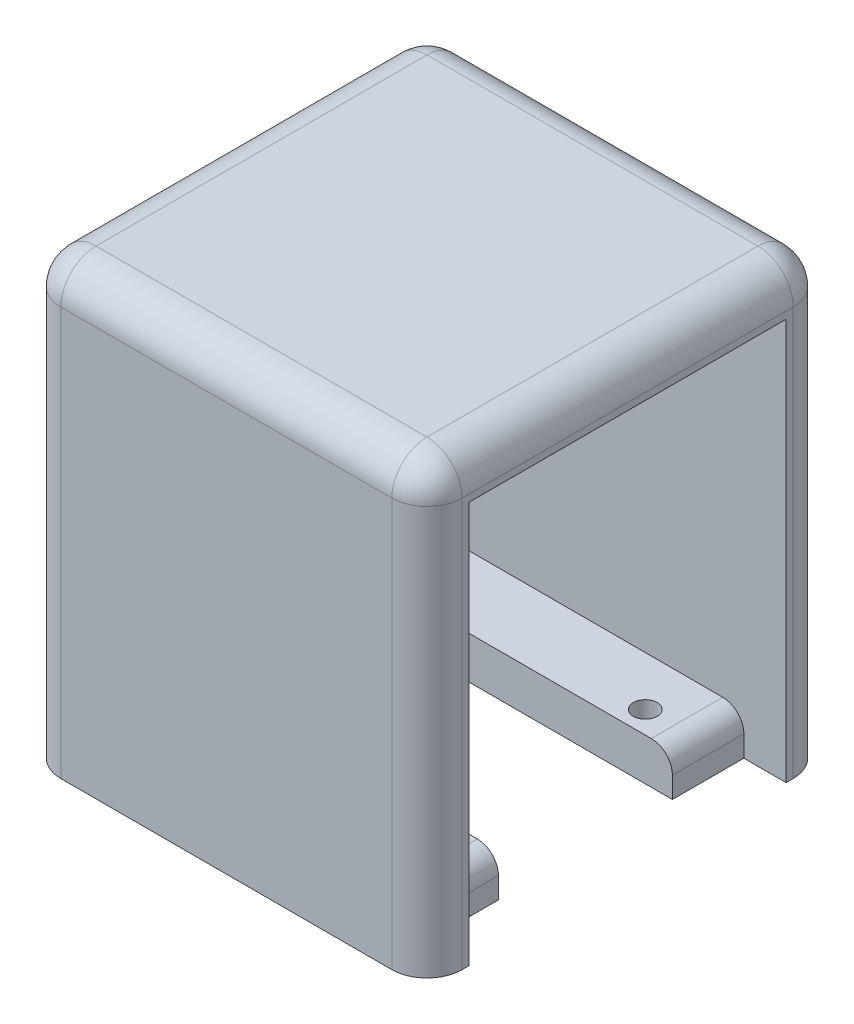
ISO-10303-21;
HEADER;
FILE_DESCRIPTION(('STEP AP214'),'2;1');
FILE_NAME('part.step','',(''),(''),'','','');
FILE_SCHEMA(('AUTOMOTIVE_DESIGN { 1 0 10303 214 1 1 1 1 }'));
ENDSEC;
DATA;
#1=APPLICATION_CONTEXT('core data for automotive mechanical design processes');
#2=APPLICATION_PROTOCOL_DEFINITION('international standard','automotive_design',2000,#1);
#3=PRODUCT_CONTEXT('',#1,'mechanical');
#4=PRODUCT('Part','Part','',(#3));
#5=PRODUCT_RELATED_PRODUCT_CATEGORY('part','',(#4));
#6=PRODUCT_DEFINITION_FORMATION('','',#4);
#7=PRODUCT_DEFINITION_CONTEXT('part definition',#1,'design');
#8=PRODUCT_DEFINITION('design','',#6,#7);
#9=PRODUCT_DEFINITION_SHAPE('','',#8);
#10=(LENGTH_UNIT() NAMED_UNIT(*) SI_UNIT(.MILLI.,.METRE.));
#11=(NAMED_UNIT(*) PLANE_ANGLE_UNIT() SI_UNIT($,.RADIAN.));
#12=(NAMED_UNIT(*) SI_UNIT($,.STERADIAN.) SOLID_ANGLE_UNIT());
#13=UNCERTAINTY_MEASURE_WITH_UNIT(LENGTH_MEASURE(1.E-05),#10,'distance_accuracy_value','');
#14=(GEOMETRIC_REPRESENTATION_CONTEXT(3) GLOBAL_UNCERTAINTY_ASSIGNED_CONTEXT((#13)) GLOBAL_UNIT_ASSIGNED_CONTEXT((#10,
#11,#12)) REPRESENTATION_CONTEXT('',''));
#15=CARTESIAN_POINT('',(0.,0.,0.));
#16=DIRECTION('',(0.,0.,1.));
#17=DIRECTION('',(1.,0.,0.));
#18=AXIS2_PLACEMENT_3D('',#15,#16,#17);
#19=CARTESIAN_POINT('',(0.,6.,0.));
#20=DIRECTION('',(0.,1.,0.));
#21=DIRECTION('',(0.,0.,1.));
#22=AXIS2_PLACEMENT_3D('',#19,#20,#21);
#23=PLANE('',#22);
#24=CARTESIAN_POINT('',(-15.5,6.,-15.5));
#25=DIRECTION('',(0.,1.,0.));
#26=DIRECTION('',(0.,0.,1.));
#27=AXIS2_PLACEMENT_3D('',#24,#25,#26);
#28=CIRCLE('',#27,1.69999999999999);
#29=CARTESIAN_POINT('',(-15.5,6.,-13.8));
#30=VERTEX_POINT('',#29);
#31=EDGE_CURVE('E500',#30,#30,#28,.F.);
#32=ORIENTED_EDGE('',*,*,#31,.T.);
#33=EDGE_LOOP('',(#32));
#34=FACE_BOUND('',#33,.T.);
#35=CARTESIAN_POINT('',(15.5,6.,15.5));
#36=DIRECTION('',(0.,1.,0.));
#37=DIRECTION('',(0.,0.,1.));
#38=AXIS2_PLACEMENT_3D('',#35,#36,#37);
#39=CIRCLE('',#38,1.69999999999999);
#40=CARTESIAN_POINT('',(15.5,6.,17.2));
#41=VERTEX_POINT('',#40);
#42=EDGE_CURVE('E283',#41,#41,#39,.F.);
#43=ORIENTED_EDGE('',*,*,#42,.T.);
#44=EDGE_LOOP('',(#43));
#45=FACE_BOUND('',#44,.T.);
#46=DIRECTION('',(1.,0.,0.));
#47=VECTOR('',#46,1.);
#48=CARTESIAN_POINT('',(0.,6.,22.5));
#49=LINE('',#48,#47);
#50=CARTESIAN_POINT('',(-22.5,6.,22.5));
#51=VERTEX_POINT('',#50);
#52=CARTESIAN_POINT('',(19.5,6.,22.5));
#53=VERTEX_POINT('',#52);
#54=EDGE_CURVE('E267',#51,#53,#49,.T.);
#55=ORIENTED_EDGE('',*,*,#54,.T.);
#56=DIRECTION('',(0.,0.,-1.));
#57=VECTOR('',#56,1.);
#58=CARTESIAN_POINT('',(19.5,6.,12.350491758616));
#59=LINE('',#58,#57);
#60=CARTESIAN_POINT('',(19.5,6.,12.350491758616));
#61=VERTEX_POINT('',#60);
#62=EDGE_CURVE('E265',#53,#61,#59,.T.);
#63=ORIENTED_EDGE('',*,*,#62,.T.);
#64=DIRECTION('',(1.,0.,0.));
#65=VECTOR('',#64,1.);
#66=CARTESIAN_POINT('',(0.,6.,12.350491758616));
#67=LINE('',#66,#65);
#68=CARTESIAN_POINT('',(-12.350491758616,6.,12.350491758616));
#69=VERTEX_POINT('',#68);
#70=EDGE_CURVE('E246',#69,#61,#67,.T.);
#71=ORIENTED_EDGE('',*,*,#70,.F.);
#72=DIRECTION('',(0.,0.,1.));
#73=VECTOR('',#72,1.);
#74=CARTESIAN_POINT('',(-12.350491758616,6.,0.));
#75=LINE('',#74,#73);
#76=CARTESIAN_POINT('',(-12.350491758616,6.,-12.350491758616));
#77=VERTEX_POINT('',#76);
#78=EDGE_CURVE('E263',#77,#69,#75,.T.);
#79=ORIENTED_EDGE('',*,*,#78,.F.);
#80=DIRECTION('',(-1.,0.,0.));
#81=VECTOR('',#80,1.);
#82=CARTESIAN_POINT('',(0.,6.,-12.350491758616));
#83=LINE('',#82,#81);
#84=CARTESIAN_POINT('',(19.5,6.,-12.350491758616));
#85=VERTEX_POINT('',#84);
#86=EDGE_CURVE('E295',#85,#77,#83,.T.);
#87=ORIENTED_EDGE('',*,*,#86,.F.);
#88=DIRECTION('',(0.,0.,-1.));
#89=VECTOR('',#88,1.);
#90=CARTESIAN_POINT('',(19.5,6.,-22.5));
#91=LINE('',#90,#89);
#92=CARTESIAN_POINT('',(19.5,6.,-22.5));
#93=VERTEX_POINT('',#92);
#94=EDGE_CURVE('E406',#85,#93,#91,.T.);
#95=ORIENTED_EDGE('',*,*,#94,.T.);
#96=DIRECTION('',(1.,0.,0.));
#97=VECTOR('',#96,1.);
#98=CARTESIAN_POINT('',(0.,6.,-22.5));
#99=LINE('',#98,#97);
#100=CARTESIAN_POINT('',(-22.5,6.00000000000001,-22.5));
#101=VERTEX_POINT('',#100);
#102=EDGE_CURVE('E487',#101,#93,#99,.T.);
#103=ORIENTED_EDGE('',*,*,#102,.F.);
#104=DIRECTION('',(0.,0.,1.));
#105=VECTOR('',#104,1.);
#106=CARTESIAN_POINT('',(-22.5,6.,0.));
#107=LINE('',#106,#105);
#108=EDGE_CURVE('E470',#101,#51,#107,.T.);
#109=ORIENTED_EDGE('',*,*,#108,.T.);
#110=EDGE_LOOP('',(#55,#63,#71,#79,#87,#95,#103,#109));
#111=FACE_BOUND('',#110,.T.);
#112=CARTESIAN_POINT('',(15.5,6.,-15.5));
#113=DIRECTION('',(0.,1.,0.));
#114=DIRECTION('',(0.,0.,1.));
#115=AXIS2_PLACEMENT_3D('',#112,#113,#114);
#116=CIRCLE('',#115,1.69999999999999);
#117=CARTESIAN_POINT('',(15.5,6.,-13.8));
#118=VERTEX_POINT('',#117);
#119=EDGE_CURVE('E509',#118,#118,#116,.F.);
#120=ORIENTED_EDGE('',*,*,#119,.T.);
#121=EDGE_LOOP('',(#120));
#122=FACE_BOUND('',#121,.T.);
#123=CARTESIAN_POINT('',(-15.5,6.,15.5));
#124=DIRECTION('',(0.,1.,0.));
#125=DIRECTION('',(0.,0.,1.));
#126=AXIS2_PLACEMENT_3D('',#123,#124,#125);
#127=CIRCLE('',#126,1.69999999999999);
#128=CARTESIAN_POINT('',(-15.5,6.,17.2));
#129=VERTEX_POINT('',#128);
#130=EDGE_CURVE('E501',#129,#129,#127,.F.);
#131=ORIENTED_EDGE('',*,*,#130,.T.);
#132=EDGE_LOOP('',(#131));
#133=FACE_BOUND('',#132,.T.);
#134=ADVANCED_FACE('F70',(#34,#45,#111,#122,#133),#23,.T.);
#135=CARTESIAN_POINT('',(-22.5,57.,-22.5));
#136=DIRECTION('',(0.,0.,-1.));
#137=DIRECTION('',(-1.,0.,0.));
#138=AXIS2_PLACEMENT_3D('',#135,#136,#137);
#139=PLANE('',#138);
#140=ORIENTED_EDGE('',*,*,#102,.T.);
#141=CARTESIAN_POINT('',(19.5,3.,-22.5));
#142=DIRECTION('',(0.,0.,-1.));
#143=DIRECTION('',(-1.,0.,0.));
#144=AXIS2_PLACEMENT_3D('',#141,#142,#143);
#145=CIRCLE('',#144,3.);
#146=CARTESIAN_POINT('',(22.5,3.,-22.5));
#147=VERTEX_POINT('',#146);
#148=EDGE_CURVE('E12',#93,#147,#145,.T.);
#149=ORIENTED_EDGE('',*,*,#148,.T.);
#150=DIRECTION('',(0.,-1.,0.));
#151=VECTOR('',#150,1.);
#152=CARTESIAN_POINT('',(22.5,6.,-22.5));
#153=LINE('',#152,#151);
#154=CARTESIAN_POINT('',(22.5,0.,-22.5));
#155=VERTEX_POINT('',#154);
#156=EDGE_CURVE('E302',#147,#155,#153,.T.);
#157=ORIENTED_EDGE('',*,*,#156,.T.);
#158=DIRECTION('',(1.,0.,0.));
#159=VECTOR('',#158,1.);
#160=CARTESIAN_POINT('',(-22.5,0.,-22.5));
#161=LINE('',#160,#159);
#162=CARTESIAN_POINT('',(28.5,0.,-22.5));
#163=VERTEX_POINT('',#162);
#164=EDGE_CURVE('E329',#155,#163,#161,.T.);
#165=ORIENTED_EDGE('',*,*,#164,.T.);
#166=DIRECTION('',(0.,1.,0.));
#167=VECTOR('',#166,1.);
#168=CARTESIAN_POINT('',(28.5,57.,-22.5));
#169=LINE('',#168,#167);
#170=CARTESIAN_POINT('',(28.5,57.,-22.5));
#171=VERTEX_POINT('',#170);
#172=EDGE_CURVE('E308',#163,#171,#169,.T.);
#173=ORIENTED_EDGE('',*,*,#172,.T.);
#174=DIRECTION('',(1.,0.,0.));
#175=VECTOR('',#174,1.);
#176=CARTESIAN_POINT('',(-22.5,57.,-22.5));
#177=LINE('',#176,#175);
#178=CARTESIAN_POINT('',(-22.5,57.,-22.5));
#179=VERTEX_POINT('',#178);
#180=EDGE_CURVE('E328',#179,#171,#177,.T.);
#181=ORIENTED_EDGE('',*,*,#180,.F.);
#182=DIRECTION('',(0.,1.,0.));
#183=VECTOR('',#182,1.);
#184=CARTESIAN_POINT('',(-22.5,57.,-22.5));
#185=LINE('',#184,#183);
#186=EDGE_CURVE('E319',#101,#179,#185,.T.);
#187=ORIENTED_EDGE('',*,*,#186,.F.);
#188=EDGE_LOOP('',(#140,#149,#157,#165,#173,#181,#187));
#189=FACE_BOUND('',#188,.T.);
#190=ADVANCED_FACE('F539',(#189),#139,.F.);
#191=CARTESIAN_POINT('',(-22.5,0.,22.5));
#192=DIRECTION('',(0.,0.,1.));
#193=DIRECTION('',(1.,0.,0.));
#194=AXIS2_PLACEMENT_3D('',#191,#192,#193);
#195=PLANE('',#194);
#196=DIRECTION('',(0.,-1.,0.));
#197=VECTOR('',#196,1.);
#198=CARTESIAN_POINT('',(22.5,6.,22.5));
#199=LINE('',#198,#197);
#200=CARTESIAN_POINT('',(22.5,3.,22.5));
#201=VERTEX_POINT('',#200);
#202=CARTESIAN_POINT('',(22.5,0.,22.5));
#203=VERTEX_POINT('',#202);
#204=EDGE_CURVE('E299',#201,#203,#199,.T.);
#205=ORIENTED_EDGE('',*,*,#204,.F.);
#206=CARTESIAN_POINT('',(19.5,3.,22.5));
#207=DIRECTION('',(0.,0.,1.));
#208=DIRECTION('',(1.,0.,0.));
#209=AXIS2_PLACEMENT_3D('',#206,#207,#208);
#210=CIRCLE('',#209,3.);
#211=EDGE_CURVE('E79',#201,#53,#210,.T.);
#212=ORIENTED_EDGE('',*,*,#211,.T.);
#213=ORIENTED_EDGE('',*,*,#54,.F.);
#214=DIRECTION('',(0.,-1.,0.));
#215=VECTOR('',#214,1.);
#216=CARTESIAN_POINT('',(-22.5,0.,22.5));
#217=LINE('',#216,#215);
#218=CARTESIAN_POINT('',(-22.5,57.,22.5));
#219=VERTEX_POINT('',#218);
#220=EDGE_CURVE('E325',#219,#51,#217,.T.);
#221=ORIENTED_EDGE('',*,*,#220,.F.);
#222=DIRECTION('',(1.,0.,0.));
#223=VECTOR('',#222,1.);
#224=CARTESIAN_POINT('',(-22.5,57.,22.5));
#225=LINE('',#224,#223);
#226=CARTESIAN_POINT('',(28.5,57.,22.5));
#227=VERTEX_POINT('',#226);
#228=EDGE_CURVE('E337',#219,#227,#225,.T.);
#229=ORIENTED_EDGE('',*,*,#228,.T.);
#230=DIRECTION('',(0.,-1.,0.));
#231=VECTOR('',#230,1.);
#232=CARTESIAN_POINT('',(28.5,0.,22.5));
#233=LINE('',#232,#231);
#234=CARTESIAN_POINT('',(28.5,0.,22.5));
#235=VERTEX_POINT('',#234);
#236=EDGE_CURVE('E315',#227,#235,#233,.T.);
#237=ORIENTED_EDGE('',*,*,#236,.T.);
#238=DIRECTION('',(1.,0.,0.));
#239=VECTOR('',#238,1.);
#240=CARTESIAN_POINT('',(-22.5,0.,22.5));
#241=LINE('',#240,#239);
#242=EDGE_CURVE('E334',#203,#235,#241,.T.);
#243=ORIENTED_EDGE('',*,*,#242,.F.);
#244=EDGE_LOOP('',(#205,#212,#213,#221,#229,#237,#243));
#245=FACE_BOUND('',#244,.T.);
#246=ADVANCED_FACE('F463',(#245),#195,.F.);
#247=CARTESIAN_POINT('',(0.,0.,0.));
#248=DIRECTION('',(0.,1.,0.));
#249=DIRECTION('',(0.,0.,1.));
#250=AXIS2_PLACEMENT_3D('',#247,#248,#249);
#251=PLANE('',#250);
#252=CARTESIAN_POINT('',(-15.5,0.,15.5));
#253=DIRECTION('',(0.,-1.,0.));
#254=DIRECTION('',(0.,0.,-1.));
#255=AXIS2_PLACEMENT_3D('',#252,#253,#254);
#256=CIRCLE('',#255,1.69999999999999);
#257=CARTESIAN_POINT('',(-15.5,0.,13.8));
#258=VERTEX_POINT('',#257);
#259=EDGE_CURVE('E443',#258,#258,#256,.T.);
#260=ORIENTED_EDGE('',*,*,#259,.F.);
#261=EDGE_LOOP('',(#260));
#262=FACE_BOUND('',#261,.T.);
#263=CARTESIAN_POINT('',(-15.5,0.,-15.5));
#264=DIRECTION('',(0.,-1.,0.));
#265=DIRECTION('',(0.,0.,-1.));
#266=AXIS2_PLACEMENT_3D('',#263,#264,#265);
#267=CIRCLE('',#266,1.69999999999999);
#268=CARTESIAN_POINT('',(-15.5,0.,-17.2));
#269=VERTEX_POINT('',#268);
#270=EDGE_CURVE('E497',#269,#269,#267,.T.);
#271=ORIENTED_EDGE('',*,*,#270,.F.);
#272=EDGE_LOOP('',(#271));
#273=FACE_BOUND('',#272,.T.);
#274=CARTESIAN_POINT('',(15.5,0.,-15.5));
#275=DIRECTION('',(0.,-1.,0.));
#276=DIRECTION('',(0.,0.,-1.));
#277=AXIS2_PLACEMENT_3D('',#274,#275,#276);
#278=CIRCLE('',#277,1.69999999999999);
#279=CARTESIAN_POINT('',(15.5,0.,-17.2));
#280=VERTEX_POINT('',#279);
#281=EDGE_CURVE('E504',#280,#280,#278,.T.);
#282=ORIENTED_EDGE('',*,*,#281,.F.);
#283=EDGE_LOOP('',(#282));
#284=FACE_BOUND('',#283,.T.);
#285=CARTESIAN_POINT('',(15.5,0.,15.5));
#286=DIRECTION('',(0.,-1.,0.));
#287=DIRECTION('',(0.,0.,-1.));
#288=AXIS2_PLACEMENT_3D('',#285,#286,#287);
#289=CIRCLE('',#288,1.69999999999999);
#290=CARTESIAN_POINT('',(15.5,0.,13.8));
#291=VERTEX_POINT('',#290);
#292=EDGE_CURVE('E515',#291,#291,#289,.T.);
#293=ORIENTED_EDGE('',*,*,#292,.F.);
#294=EDGE_LOOP('',(#293));
#295=FACE_BOUND('',#294,.T.);
#296=DIRECTION('',(0.,0.,1.));
#297=VECTOR('',#296,1.);
#298=CARTESIAN_POINT('',(-28.4999999999999,0.,0.));
#299=LINE('',#298,#297);
#300=CARTESIAN_POINT('',(-28.4999999999999,0.,-23.5));
#301=VERTEX_POINT('',#300);
#302=CARTESIAN_POINT('',(-28.4999999999999,0.,23.5));
#303=VERTEX_POINT('',#302);
#304=EDGE_CURVE('E349',#301,#303,#299,.T.);
#305=ORIENTED_EDGE('',*,*,#304,.F.);
#306=CARTESIAN_POINT('',(-23.4999999999999,0.,-23.5));
#307=DIRECTION('',(0.,1.,0.));
#308=DIRECTION('',(0.,0.,1.));
#309=AXIS2_PLACEMENT_3D('',#306,#307,#308);
#310=CIRCLE('',#309,5.);
#311=CARTESIAN_POINT('',(-23.4999999999999,0.,-28.5));
#312=VERTEX_POINT('',#311);
#313=EDGE_CURVE('E404',#301,#312,#310,.F.);
#314=ORIENTED_EDGE('',*,*,#313,.T.);
#315=DIRECTION('',(1.,0.,0.));
#316=VECTOR('',#315,1.);
#317=CARTESIAN_POINT('',(0.,0.,-28.5));
#318=LINE('',#317,#316);
#319=CARTESIAN_POINT('',(23.5,0.,-28.5));
#320=VERTEX_POINT('',#319);
#321=EDGE_CURVE('E345',#312,#320,#318,.T.);
#322=ORIENTED_EDGE('',*,*,#321,.T.);
#323=CARTESIAN_POINT('',(23.5,0.,-23.5));
#324=DIRECTION('',(0.,1.,0.));
#325=DIRECTION('',(0.,0.,1.));
#326=AXIS2_PLACEMENT_3D('',#323,#324,#325);
#327=CIRCLE('',#326,5.);
#328=CARTESIAN_POINT('',(28.5,0.,-23.5));
#329=VERTEX_POINT('',#328);
#330=EDGE_CURVE('E401',#320,#329,#327,.F.);
#331=ORIENTED_EDGE('',*,*,#330,.T.);
#332=DIRECTION('',(0.,0.,1.));
#333=VECTOR('',#332,1.);
#334=CARTESIAN_POINT('',(28.5,0.,0.));
#335=LINE('',#334,#333);
#336=EDGE_CURVE('E342',#329,#163,#335,.T.);
#337=ORIENTED_EDGE('',*,*,#336,.T.);
#338=ORIENTED_EDGE('',*,*,#164,.F.);
#339=DIRECTION('',(0.,0.,-1.));
#340=VECTOR('',#339,1.);
#341=CARTESIAN_POINT('',(22.5,0.,0.));
#342=LINE('',#341,#340);
#343=CARTESIAN_POINT('',(22.5,0.,-12.350491758616));
#344=VERTEX_POINT('',#343);
#345=EDGE_CURVE('E282',#344,#155,#342,.T.);
#346=ORIENTED_EDGE('',*,*,#345,.F.);
#347=DIRECTION('',(-1.,0.,0.));
#348=VECTOR('',#347,1.);
#349=CARTESIAN_POINT('',(0.,0.,-12.350491758616));
#350=LINE('',#349,#348);
#351=CARTESIAN_POINT('',(-12.350491758616,0.,-12.350491758616));
#352=VERTEX_POINT('',#351);
#353=EDGE_CURVE('E278',#344,#352,#350,.T.);
#354=ORIENTED_EDGE('',*,*,#353,.T.);
#355=DIRECTION('',(0.,0.,1.));
#356=VECTOR('',#355,1.);
#357=CARTESIAN_POINT('',(-12.350491758616,0.,0.));
#358=LINE('',#357,#356);
#359=CARTESIAN_POINT('',(-12.350491758616,0.,12.350491758616));
#360=VERTEX_POINT('',#359);
#361=EDGE_CURVE('E293',#352,#360,#358,.T.);
#362=ORIENTED_EDGE('',*,*,#361,.T.);
#363=DIRECTION('',(1.,0.,0.));
#364=VECTOR('',#363,1.);
#365=CARTESIAN_POINT('',(0.,0.,12.350491758616));
#366=LINE('',#365,#364);
#367=CARTESIAN_POINT('',(22.5,0.,12.350491758616));
#368=VERTEX_POINT('',#367);
#369=EDGE_CURVE('E248',#360,#368,#366,.T.);
#370=ORIENTED_EDGE('',*,*,#369,.T.);
#371=DIRECTION('',(0.,0.,-1.));
#372=VECTOR('',#371,1.);
#373=CARTESIAN_POINT('',(22.5,0.,0.));
#374=LINE('',#373,#372);
#375=EDGE_CURVE('E287',#203,#368,#374,.T.);
#376=ORIENTED_EDGE('',*,*,#375,.F.);
#377=ORIENTED_EDGE('',*,*,#242,.T.);
#378=CARTESIAN_POINT('',(28.5,0.,23.5));
#379=VERTEX_POINT('',#378);
#380=EDGE_CURVE('E333',#235,#379,#335,.T.);
#381=ORIENTED_EDGE('',*,*,#380,.T.);
#382=CARTESIAN_POINT('',(23.5,0.,23.5));
#383=DIRECTION('',(0.,1.,0.));
#384=DIRECTION('',(0.,0.,1.));
#385=AXIS2_PLACEMENT_3D('',#382,#383,#384);
#386=CIRCLE('',#385,5.);
#387=CARTESIAN_POINT('',(23.5,0.,28.5));
#388=VERTEX_POINT('',#387);
#389=EDGE_CURVE('E396',#379,#388,#386,.F.);
#390=ORIENTED_EDGE('',*,*,#389,.T.);
#391=DIRECTION('',(1.,0.,0.));
#392=VECTOR('',#391,1.);
#393=CARTESIAN_POINT('',(0.,0.,28.5));
#394=LINE('',#393,#392);
#395=CARTESIAN_POINT('',(-23.4999999999999,0.,28.5));
#396=VERTEX_POINT('',#395);
#397=EDGE_CURVE('E352',#396,#388,#394,.T.);
#398=ORIENTED_EDGE('',*,*,#397,.F.);
#399=CARTESIAN_POINT('',(-23.4999999999999,0.,23.5));
#400=DIRECTION('',(0.,1.,0.));
#401=DIRECTION('',(0.,0.,1.));
#402=AXIS2_PLACEMENT_3D('',#399,#400,#401);
#403=CIRCLE('',#402,5.);
#404=EDGE_CURVE('E399',#396,#303,#403,.F.);
#405=ORIENTED_EDGE('',*,*,#404,.T.);
#406=EDGE_LOOP('',(#305,#314,#322,#331,#337,#338,#346,#354,#362,#370,#376,#377,#381,#390,#398,#405));
#407=FACE_BOUND('',#406,.T.);
#408=ADVANCED_FACE('F479',(#262,#273,#284,#295,#407),#251,.F.);
#409=CARTESIAN_POINT('',(-28.4999999999999,63.,0.));
#410=DIRECTION('',(1.,0.,0.));
#411=DIRECTION('',(0.,0.,-1.));
#412=AXIS2_PLACEMENT_3D('',#409,#410,#411);
#413=PLANE('',#412);
#414=DIRECTION('',(0.,0.,1.));
#415=VECTOR('',#414,1.);
#416=CARTESIAN_POINT('',(-28.4999999999999,58.,-28.5));
#417=LINE('',#416,#415);
#418=CARTESIAN_POINT('',(-28.4999999999999,58.,23.5));
#419=VERTEX_POINT('',#418);
#420=CARTESIAN_POINT('',(-28.4999999999999,58.,-23.5));
#421=VERTEX_POINT('',#420);
#422=EDGE_CURVE('E383',#419,#421,#417,.F.);
#423=ORIENTED_EDGE('',*,*,#422,.T.);
#424=DIRECTION('',(0.,-1.,0.));
#425=VECTOR('',#424,1.);
#426=CARTESIAN_POINT('',(-28.4999999999999,0.,-23.5));
#427=LINE('',#426,#425);
#428=EDGE_CURVE('E385',#421,#301,#427,.T.);
#429=ORIENTED_EDGE('',*,*,#428,.T.);
#430=ORIENTED_EDGE('',*,*,#304,.T.);
#431=DIRECTION('',(0.,-1.,0.));
#432=VECTOR('',#431,1.);
#433=CARTESIAN_POINT('',(-28.4999999999999,63.,23.5));
#434=LINE('',#433,#432);
#435=EDGE_CURVE('E381',#303,#419,#434,.F.);
#436=ORIENTED_EDGE('',*,*,#435,.T.);
#437=EDGE_LOOP('',(#423,#429,#430,#436));
#438=FACE_BOUND('',#437,.T.);
#439=ADVANCED_FACE('F561',(#438),#413,.F.);
#440=CARTESIAN_POINT('',(0.,63.,-28.5));
#441=DIRECTION('',(0.,0.,-1.));
#442=DIRECTION('',(-1.,0.,0.));
#443=AXIS2_PLACEMENT_3D('',#440,#441,#442);
#444=PLANE('',#443);
#445=ORIENTED_EDGE('',*,*,#321,.F.);
#446=DIRECTION('',(0.,-1.,0.));
#447=VECTOR('',#446,1.);
#448=CARTESIAN_POINT('',(-23.4999999999999,63.,-28.5));
#449=LINE('',#448,#447);
#450=CARTESIAN_POINT('',(-23.4999999999999,58.,-28.5));
#451=VERTEX_POINT('',#450);
#452=EDGE_CURVE('E362',#312,#451,#449,.F.);
#453=ORIENTED_EDGE('',*,*,#452,.T.);
#454=DIRECTION('',(1.,0.,0.));
#455=VECTOR('',#454,1.);
#456=CARTESIAN_POINT('',(0.,58.,-28.5));
#457=LINE('',#456,#455);
#458=CARTESIAN_POINT('',(23.5,58.,-28.5));
#459=VERTEX_POINT('',#458);
#460=EDGE_CURVE('E359',#451,#459,#457,.T.);
#461=ORIENTED_EDGE('',*,*,#460,.T.);
#462=DIRECTION('',(0.,-1.,0.));
#463=VECTOR('',#462,1.);
#464=CARTESIAN_POINT('',(23.5,63.,-28.5));
#465=LINE('',#464,#463);
#466=EDGE_CURVE('E356',#459,#320,#465,.T.);
#467=ORIENTED_EDGE('',*,*,#466,.T.);
#468=EDGE_LOOP('',(#445,#453,#461,#467));
#469=FACE_BOUND('',#468,.T.);
#470=ADVANCED_FACE('F573',(#469),#444,.T.);
#471=CARTESIAN_POINT('',(28.5,63.,0.));
#472=DIRECTION('',(1.,0.,0.));
#473=DIRECTION('',(0.,0.,-1.));
#474=AXIS2_PLACEMENT_3D('',#471,#472,#473);
#475=PLANE('',#474);
#476=ORIENTED_EDGE('',*,*,#336,.F.);
#477=DIRECTION('',(0.,-1.,0.));
#478=VECTOR('',#477,1.);
#479=CARTESIAN_POINT('',(28.5,63.,-23.5));
#480=LINE('',#479,#478);
#481=CARTESIAN_POINT('',(28.5,58.,-23.5));
#482=VERTEX_POINT('',#481);
#483=EDGE_CURVE('E393',#329,#482,#480,.F.);
#484=ORIENTED_EDGE('',*,*,#483,.T.);
#485=DIRECTION('',(0.,0.,1.));
#486=VECTOR('',#485,1.);
#487=CARTESIAN_POINT('',(28.5,58.,0.));
#488=LINE('',#487,#486);
#489=CARTESIAN_POINT('',(28.5,58.,23.5));
#490=VERTEX_POINT('',#489);
#491=EDGE_CURVE('E390',#482,#490,#488,.T.);
#492=ORIENTED_EDGE('',*,*,#491,.T.);
#493=DIRECTION('',(0.,-1.,0.));
#494=VECTOR('',#493,1.);
#495=CARTESIAN_POINT('',(28.5,0.,23.5));
#496=LINE('',#495,#494);
#497=EDGE_CURVE('E387',#490,#379,#496,.T.);
#498=ORIENTED_EDGE('',*,*,#497,.T.);
#499=ORIENTED_EDGE('',*,*,#380,.F.);
#500=ORIENTED_EDGE('',*,*,#236,.F.);
#501=DIRECTION('',(0.,0.,1.));
#502=VECTOR('',#501,1.);
#503=CARTESIAN_POINT('',(28.5,57.,22.5));
#504=LINE('',#503,#502);
#505=EDGE_CURVE('E311',#171,#227,#504,.T.);
#506=ORIENTED_EDGE('',*,*,#505,.F.);
#507=ORIENTED_EDGE('',*,*,#172,.F.);
#508=EDGE_LOOP('',(#476,#484,#492,#498,#499,#500,#506,#507));
#509=FACE_BOUND('',#508,.T.);
#510=ADVANCED_FACE('F576',(#509),#475,.T.);
#511=CARTESIAN_POINT('',(0.,63.,28.5));
#512=DIRECTION('',(0.,0.,-1.));
#513=DIRECTION('',(-1.,0.,0.));
#514=AXIS2_PLACEMENT_3D('',#511,#512,#513);
#515=PLANE('',#514);
#516=DIRECTION('',(1.,0.,0.));
#517=VECTOR('',#516,1.);
#518=CARTESIAN_POINT('',(-28.4999999999999,58.,28.5));
#519=LINE('',#518,#517);
#520=CARTESIAN_POINT('',(23.5,58.,28.5));
#521=VERTEX_POINT('',#520);
#522=CARTESIAN_POINT('',(-23.4999999999999,58.,28.5));
#523=VERTEX_POINT('',#522);
#524=EDGE_CURVE('E377',#521,#523,#519,.F.);
#525=ORIENTED_EDGE('',*,*,#524,.T.);
#526=DIRECTION('',(0.,-1.,0.));
#527=VECTOR('',#526,1.);
#528=CARTESIAN_POINT('',(-23.4999999999999,63.,28.5));
#529=LINE('',#528,#527);
#530=EDGE_CURVE('E379',#523,#396,#529,.T.);
#531=ORIENTED_EDGE('',*,*,#530,.T.);
#532=ORIENTED_EDGE('',*,*,#397,.T.);
#533=DIRECTION('',(0.,-1.,0.));
#534=VECTOR('',#533,1.);
#535=CARTESIAN_POINT('',(23.5,63.,28.5));
#536=LINE('',#535,#534);
#537=EDGE_CURVE('E374',#388,#521,#536,.F.);
#538=ORIENTED_EDGE('',*,*,#537,.T.);
#539=EDGE_LOOP('',(#525,#531,#532,#538));
#540=FACE_BOUND('',#539,.T.);
#541=ADVANCED_FACE('F568',(#540),#515,.F.);
#542=CARTESIAN_POINT('',(0.,63.,0.));
#543=DIRECTION('',(0.,1.,0.));
#544=DIRECTION('',(0.,0.,1.));
#545=AXIS2_PLACEMENT_3D('',#542,#543,#544);
#546=PLANE('',#545);
#547=DIRECTION('',(1.,0.,0.));
#548=VECTOR('',#547,1.);
#549=CARTESIAN_POINT('',(0.,63.,-23.5));
#550=LINE('',#549,#548);
#551=CARTESIAN_POINT('',(23.5,63.,-23.5));
#552=VERTEX_POINT('',#551);
#553=CARTESIAN_POINT('',(-23.4999999999999,63.,-23.5));
#554=VERTEX_POINT('',#553);
#555=EDGE_CURVE('E369',#552,#554,#550,.F.);
#556=ORIENTED_EDGE('',*,*,#555,.T.);
#557=DIRECTION('',(0.,0.,1.));
#558=VECTOR('',#557,1.);
#559=CARTESIAN_POINT('',(-23.4999999999999,63.,28.5));
#560=LINE('',#559,#558);
#561=CARTESIAN_POINT('',(-23.4999999999999,63.,23.5));
#562=VERTEX_POINT('',#561);
#563=EDGE_CURVE('E372',#554,#562,#560,.T.);
#564=ORIENTED_EDGE('',*,*,#563,.T.);
#565=DIRECTION('',(1.,0.,0.));
#566=VECTOR('',#565,1.);
#567=CARTESIAN_POINT('',(28.5,63.,23.5));
#568=LINE('',#567,#566);
#569=CARTESIAN_POINT('',(23.5,63.,23.5));
#570=VERTEX_POINT('',#569);
#571=EDGE_CURVE('E367',#562,#570,#568,.T.);
#572=ORIENTED_EDGE('',*,*,#571,.T.);
#573=DIRECTION('',(0.,0.,1.));
#574=VECTOR('',#573,1.);
#575=CARTESIAN_POINT('',(23.5,63.,0.));
#576=LINE('',#575,#574);
#577=EDGE_CURVE('E364',#570,#552,#576,.F.);
#578=ORIENTED_EDGE('',*,*,#577,.T.);
#579=EDGE_LOOP('',(#556,#564,#572,#578));
#580=FACE_BOUND('',#579,.T.);
#581=ADVANCED_FACE('F563',(#580),#546,.T.);
#582=CARTESIAN_POINT('',(-22.5,57.,22.5));
#583=DIRECTION('',(0.,1.,0.));
#584=DIRECTION('',(0.,0.,1.));
#585=AXIS2_PLACEMENT_3D('',#582,#583,#584);
#586=PLANE('',#585);
#587=ORIENTED_EDGE('',*,*,#228,.F.);
#588=DIRECTION('',(0.,0.,1.));
#589=VECTOR('',#588,1.);
#590=CARTESIAN_POINT('',(-22.5,57.,22.5));
#591=LINE('',#590,#589);
#592=EDGE_CURVE('E322',#179,#219,#591,.T.);
#593=ORIENTED_EDGE('',*,*,#592,.F.);
#594=ORIENTED_EDGE('',*,*,#180,.T.);
#595=ORIENTED_EDGE('',*,*,#505,.T.);
#596=EDGE_LOOP('',(#587,#593,#594,#595));
#597=FACE_BOUND('',#596,.T.);
#598=ADVANCED_FACE('F557',(#597),#586,.F.);
#599=CARTESIAN_POINT('',(-22.5,0.,0.));
#600=DIRECTION('',(1.,0.,0.));
#601=DIRECTION('',(0.,0.,-1.));
#602=AXIS2_PLACEMENT_3D('',#599,#600,#601);
#603=PLANE('',#602);
#604=ORIENTED_EDGE('',*,*,#108,.F.);
#605=ORIENTED_EDGE('',*,*,#186,.T.);
#606=ORIENTED_EDGE('',*,*,#592,.T.);
#607=ORIENTED_EDGE('',*,*,#220,.T.);
#608=EDGE_LOOP('',(#604,#605,#606,#607));
#609=FACE_BOUND('',#608,.T.);
#610=ADVANCED_FACE('F554',(#609),#603,.T.);
#611=CARTESIAN_POINT('',(0.,6.,-12.350491758616));
#612=DIRECTION('',(0.,0.,1.));
#613=DIRECTION('',(1.,0.,0.));
#614=AXIS2_PLACEMENT_3D('',#611,#612,#613);
#615=PLANE('',#614);
#616=DIRECTION('',(0.,-1.,0.));
#617=VECTOR('',#616,1.);
#618=CARTESIAN_POINT('',(22.5,6.,-12.350491758616));
#619=LINE('',#618,#617);
#620=CARTESIAN_POINT('',(22.5,3.,-12.350491758616));
#621=VERTEX_POINT('',#620);
#622=EDGE_CURVE('E305',#621,#344,#619,.T.);
#623=ORIENTED_EDGE('',*,*,#622,.F.);
#624=CARTESIAN_POINT('',(19.5,3.,-12.350491758616));
#625=DIRECTION('',(0.,0.,1.));
#626=DIRECTION('',(1.,0.,0.));
#627=AXIS2_PLACEMENT_3D('',#624,#625,#626);
#628=CIRCLE('',#627,3.);
#629=EDGE_CURVE('E457',#621,#85,#628,.T.);
#630=ORIENTED_EDGE('',*,*,#629,.T.);
#631=ORIENTED_EDGE('',*,*,#86,.T.);
#632=DIRECTION('',(0.,-1.,0.));
#633=VECTOR('',#632,1.);
#634=CARTESIAN_POINT('',(-12.350491758616,6.,-12.350491758616));
#635=LINE('',#634,#633);
#636=EDGE_CURVE('E255',#77,#352,#635,.T.);
#637=ORIENTED_EDGE('',*,*,#636,.T.);
#638=ORIENTED_EDGE('',*,*,#353,.F.);
#639=EDGE_LOOP('',(#623,#630,#631,#637,#638));
#640=FACE_BOUND('',#639,.T.);
#641=ADVANCED_FACE('F484',(#640),#615,.T.);
#642=CARTESIAN_POINT('',(22.5,6.,0.));
#643=DIRECTION('',(-1.,0.,0.));
#644=DIRECTION('',(0.,0.,1.));
#645=AXIS2_PLACEMENT_3D('',#642,#643,#644);
#646=PLANE('',#645);
#647=ORIENTED_EDGE('',*,*,#156,.F.);
#648=DIRECTION('',(0.,0.,-1.));
#649=VECTOR('',#648,1.);
#650=CARTESIAN_POINT('',(22.5,3.,-12.350491758616));
#651=LINE('',#650,#649);
#652=EDGE_CURVE('E89',#147,#621,#651,.F.);
#653=ORIENTED_EDGE('',*,*,#652,.T.);
#654=ORIENTED_EDGE('',*,*,#622,.T.);
#655=ORIENTED_EDGE('',*,*,#345,.T.);
#656=EDGE_LOOP('',(#647,#653,#654,#655));
#657=FACE_BOUND('',#656,.T.);
#658=ADVANCED_FACE('F549',(#657),#646,.F.);
#659=CARTESIAN_POINT('',(22.5,6.,0.));
#660=DIRECTION('',(-1.,0.,0.));
#661=DIRECTION('',(0.,0.,1.));
#662=AXIS2_PLACEMENT_3D('',#659,#660,#661);
#663=PLANE('',#662);
#664=DIRECTION('',(0.,-1.,0.));
#665=VECTOR('',#664,1.);
#666=CARTESIAN_POINT('',(22.5,6.,12.350491758616));
#667=LINE('',#666,#665);
#668=CARTESIAN_POINT('',(22.5,3.,12.350491758616));
#669=VERTEX_POINT('',#668);
#670=EDGE_CURVE('E254',#669,#368,#667,.T.);
#671=ORIENTED_EDGE('',*,*,#670,.F.);
#672=DIRECTION('',(0.,0.,-1.));
#673=VECTOR('',#672,1.);
#674=CARTESIAN_POINT('',(22.5,3.,22.5));
#675=LINE('',#674,#673);
#676=EDGE_CURVE('E452',#669,#201,#675,.F.);
#677=ORIENTED_EDGE('',*,*,#676,.T.);
#678=ORIENTED_EDGE('',*,*,#204,.T.);
#679=ORIENTED_EDGE('',*,*,#375,.T.);
#680=EDGE_LOOP('',(#671,#677,#678,#679));
#681=FACE_BOUND('',#680,.T.);
#682=ADVANCED_FACE('F475',(#681),#663,.F.);
#683=CARTESIAN_POINT('',(0.,6.,12.350491758616));
#684=DIRECTION('',(0.,0.,-1.));
#685=DIRECTION('',(-1.,0.,0.));
#686=AXIS2_PLACEMENT_3D('',#683,#684,#685);
#687=PLANE('',#686);
#688=ORIENTED_EDGE('',*,*,#70,.T.);
#689=CARTESIAN_POINT('',(19.5,3.,12.350491758616));
#690=DIRECTION('',(0.,0.,-1.));
#691=DIRECTION('',(-1.,0.,0.));
#692=AXIS2_PLACEMENT_3D('',#689,#690,#691);
#693=CIRCLE('',#692,3.);
#694=EDGE_CURVE('E449',#61,#669,#693,.T.);
#695=ORIENTED_EDGE('',*,*,#694,.T.);
#696=ORIENTED_EDGE('',*,*,#670,.T.);
#697=ORIENTED_EDGE('',*,*,#369,.F.);
#698=DIRECTION('',(0.,-1.,0.));
#699=VECTOR('',#698,1.);
#700=CARTESIAN_POINT('',(-12.350491758616,6.,12.350491758616));
#701=LINE('',#700,#699);
#702=EDGE_CURVE('E243',#69,#360,#701,.T.);
#703=ORIENTED_EDGE('',*,*,#702,.F.);
#704=EDGE_LOOP('',(#688,#695,#696,#697,#703));
#705=FACE_BOUND('',#704,.T.);
#706=ADVANCED_FACE('F245',(#705),#687,.T.);
#707=CARTESIAN_POINT('',(-12.350491758616,6.,0.));
#708=DIRECTION('',(1.,0.,0.));
#709=DIRECTION('',(0.,0.,-1.));
#710=AXIS2_PLACEMENT_3D('',#707,#708,#709);
#711=PLANE('',#710);
#712=ORIENTED_EDGE('',*,*,#361,.F.);
#713=ORIENTED_EDGE('',*,*,#636,.F.);
#714=ORIENTED_EDGE('',*,*,#78,.T.);
#715=ORIENTED_EDGE('',*,*,#702,.T.);
#716=EDGE_LOOP('',(#712,#713,#714,#715));
#717=FACE_BOUND('',#716,.T.);
#718=ADVANCED_FACE('F270',(#717),#711,.T.);
#719=CARTESIAN_POINT('',(15.5,0.,15.5));
#720=DIRECTION('',(0.,-1.,0.));
#721=DIRECTION('',(0.,0.,-1.));
#722=AXIS2_PLACEMENT_3D('',#719,#720,#721);
#723=CYLINDRICAL_SURFACE('',#722,1.69999999999999);
#724=ORIENTED_EDGE('',*,*,#42,.F.);
#725=EDGE_LOOP('',(#724));
#726=FACE_BOUND('',#725,.T.);
#727=ORIENTED_EDGE('',*,*,#292,.T.);
#728=EDGE_LOOP('',(#727));
#729=FACE_BOUND('',#728,.T.);
#730=ADVANCED_FACE('F525',(#726,#729),#723,.F.);
#731=CARTESIAN_POINT('',(15.5,0.,-15.5));
#732=DIRECTION('',(0.,-1.,0.));
#733=DIRECTION('',(0.,0.,-1.));
#734=AXIS2_PLACEMENT_3D('',#731,#732,#733);
#735=CYLINDRICAL_SURFACE('',#734,1.69999999999999);
#736=ORIENTED_EDGE('',*,*,#119,.F.);
#737=EDGE_LOOP('',(#736));
#738=FACE_BOUND('',#737,.T.);
#739=ORIENTED_EDGE('',*,*,#281,.T.);
#740=EDGE_LOOP('',(#739));
#741=FACE_BOUND('',#740,.T.);
#742=ADVANCED_FACE('F527',(#738,#741),#735,.F.);
#743=CARTESIAN_POINT('',(-15.5,0.,-15.5));
#744=DIRECTION('',(0.,-1.,0.));
#745=DIRECTION('',(0.,0.,-1.));
#746=AXIS2_PLACEMENT_3D('',#743,#744,#745);
#747=CYLINDRICAL_SURFACE('',#746,1.69999999999999);
#748=ORIENTED_EDGE('',*,*,#31,.F.);
#749=EDGE_LOOP('',(#748));
#750=FACE_BOUND('',#749,.T.);
#751=ORIENTED_EDGE('',*,*,#270,.T.);
#752=EDGE_LOOP('',(#751));
#753=FACE_BOUND('',#752,.T.);
#754=ADVANCED_FACE('F533',(#750,#753),#747,.F.);
#755=CARTESIAN_POINT('',(-15.5,0.,15.5));
#756=DIRECTION('',(0.,-1.,0.));
#757=DIRECTION('',(0.,0.,-1.));
#758=AXIS2_PLACEMENT_3D('',#755,#756,#757);
#759=CYLINDRICAL_SURFACE('',#758,1.69999999999999);
#760=ORIENTED_EDGE('',*,*,#130,.F.);
#761=EDGE_LOOP('',(#760));
#762=FACE_BOUND('',#761,.T.);
#763=ORIENTED_EDGE('',*,*,#259,.T.);
#764=EDGE_LOOP('',(#763));
#765=FACE_BOUND('',#764,.T.);
#766=ADVANCED_FACE('F633',(#762,#765),#759,.F.);
#767=CARTESIAN_POINT('',(-23.4999999999999,63.,23.5));
#768=DIRECTION('',(0.,-1.,0.));
#769=DIRECTION('',(0.,0.,-1.));
#770=AXIS2_PLACEMENT_3D('',#767,#768,#769);
#771=CYLINDRICAL_SURFACE('',#770,5.);
#772=ORIENTED_EDGE('',*,*,#404,.F.);
#773=ORIENTED_EDGE('',*,*,#530,.F.);
#774=CARTESIAN_POINT('',(-23.4999999999999,58.,23.5));
#775=DIRECTION('',(0.,1.,0.));
#776=DIRECTION('',(0.,0.,1.));
#777=AXIS2_PLACEMENT_3D('',#774,#775,#776);
#778=CIRCLE('',#777,5.);
#779=EDGE_CURVE('E437',#419,#523,#778,.T.);
#780=ORIENTED_EDGE('',*,*,#779,.F.);
#781=ORIENTED_EDGE('',*,*,#435,.F.);
#782=EDGE_LOOP('',(#772,#773,#780,#781));
#783=FACE_BOUND('',#782,.T.);
#784=ADVANCED_FACE('F630',(#783),#771,.T.);
#785=CARTESIAN_POINT('',(23.5,63.,23.5));
#786=DIRECTION('',(0.,1.,0.));
#787=DIRECTION('',(0.,0.,1.));
#788=AXIS2_PLACEMENT_3D('',#785,#786,#787);
#789=CYLINDRICAL_SURFACE('',#788,5.);
#790=ORIENTED_EDGE('',*,*,#389,.F.);
#791=ORIENTED_EDGE('',*,*,#497,.F.);
#792=CARTESIAN_POINT('',(23.5,58.,23.5));
#793=DIRECTION('',(0.,1.,0.));
#794=DIRECTION('',(0.,0.,1.));
#795=AXIS2_PLACEMENT_3D('',#792,#793,#794);
#796=CIRCLE('',#795,5.);
#797=EDGE_CURVE('E434',#521,#490,#796,.T.);
#798=ORIENTED_EDGE('',*,*,#797,.F.);
#799=ORIENTED_EDGE('',*,*,#537,.F.);
#800=EDGE_LOOP('',(#790,#791,#798,#799));
#801=FACE_BOUND('',#800,.T.);
#802=ADVANCED_FACE('F626',(#801),#789,.T.);
#803=CARTESIAN_POINT('',(0.,58.,23.5));
#804=DIRECTION('',(-1.,0.,0.));
#805=DIRECTION('',(0.,0.,1.));
#806=AXIS2_PLACEMENT_3D('',#803,#804,#805);
#807=CYLINDRICAL_SURFACE('',#806,5.);
#808=CARTESIAN_POINT('',(-23.4999999999999,58.,23.5));
#809=DIRECTION('',(-1.,0.,0.));
#810=DIRECTION('',(0.,-1.,0.));
#811=AXIS2_PLACEMENT_3D('',#808,#809,#810);
#812=CIRCLE('',#811,5.);
#813=EDGE_CURVE('E440',#523,#562,#812,.T.);
#814=ORIENTED_EDGE('',*,*,#813,.F.);
#815=ORIENTED_EDGE('',*,*,#524,.F.);
#816=CARTESIAN_POINT('',(23.5,58.,23.5));
#817=DIRECTION('',(1.,0.,0.));
#818=DIRECTION('',(0.,0.,-1.));
#819=AXIS2_PLACEMENT_3D('',#816,#817,#818);
#820=CIRCLE('',#819,5.);
#821=EDGE_CURVE('E431',#570,#521,#820,.T.);
#822=ORIENTED_EDGE('',*,*,#821,.F.);
#823=ORIENTED_EDGE('',*,*,#571,.F.);
#824=EDGE_LOOP('',(#814,#815,#822,#823));
#825=FACE_BOUND('',#824,.T.);
#826=ADVANCED_FACE('F622',(#825),#807,.T.);
#827=CARTESIAN_POINT('',(-23.4999999999999,58.,23.5));
#828=DIRECTION('',(0.,0.,1.));
#829=DIRECTION('',(1.,0.,0.));
#830=AXIS2_PLACEMENT_3D('',#827,#828,#829);
#831=SPHERICAL_SURFACE('',#830,5.);
#832=ORIENTED_EDGE('',*,*,#779,.T.);
#833=ORIENTED_EDGE('',*,*,#813,.T.);
#834=CARTESIAN_POINT('',(-23.4999999999999,58.,23.5));
#835=DIRECTION('',(0.,0.,1.));
#836=DIRECTION('',(1.,0.,0.));
#837=AXIS2_PLACEMENT_3D('',#834,#835,#836);
#838=CIRCLE('',#837,5.);
#839=EDGE_CURVE('E428',#419,#562,#838,.F.);
#840=ORIENTED_EDGE('',*,*,#839,.F.);
#841=EDGE_LOOP('',(#832,#833,#840));
#842=FACE_BOUND('',#841,.T.);
#843=ADVANCED_FACE('F618',(#842),#831,.T.);
#844=CARTESIAN_POINT('',(23.5,58.,23.5));
#845=DIRECTION('',(0.,0.,1.));
#846=DIRECTION('',(1.,0.,0.));
#847=AXIS2_PLACEMENT_3D('',#844,#845,#846);
#848=SPHERICAL_SURFACE('',#847,5.);
#849=ORIENTED_EDGE('',*,*,#821,.T.);
#850=ORIENTED_EDGE('',*,*,#797,.T.);
#851=CARTESIAN_POINT('',(23.5,58.,23.5));
#852=DIRECTION('',(0.,0.,1.));
#853=DIRECTION('',(0.,-1.,0.));
#854=AXIS2_PLACEMENT_3D('',#851,#852,#853);
#855=CIRCLE('',#854,5.);
#856=EDGE_CURVE('E425',#570,#490,#855,.F.);
#857=ORIENTED_EDGE('',*,*,#856,.F.);
#858=EDGE_LOOP('',(#849,#850,#857));
#859=FACE_BOUND('',#858,.T.);
#860=ADVANCED_FACE('F614',(#859),#848,.T.);
#861=CARTESIAN_POINT('',(-23.4999999999999,58.,0.));
#862=DIRECTION('',(0.,0.,-1.));
#863=DIRECTION('',(-1.,0.,0.));
#864=AXIS2_PLACEMENT_3D('',#861,#862,#863);
#865=CYLINDRICAL_SURFACE('',#864,5.);
#866=ORIENTED_EDGE('',*,*,#839,.T.);
#867=ORIENTED_EDGE('',*,*,#563,.F.);
#868=CARTESIAN_POINT('',(-23.4999999999999,58.,-23.5));
#869=DIRECTION('',(0.,0.,-1.));
#870=DIRECTION('',(-1.,0.,0.));
#871=AXIS2_PLACEMENT_3D('',#868,#869,#870);
#872=CIRCLE('',#871,5.);
#873=EDGE_CURVE('E422',#421,#554,#872,.T.);
#874=ORIENTED_EDGE('',*,*,#873,.F.);
#875=ORIENTED_EDGE('',*,*,#422,.F.);
#876=EDGE_LOOP('',(#866,#867,#874,#875));
#877=FACE_BOUND('',#876,.T.);
#878=ADVANCED_FACE('F610',(#877),#865,.T.);
#879=CARTESIAN_POINT('',(-23.4999999999999,63.,-23.5));
#880=DIRECTION('',(0.,1.,0.));
#881=DIRECTION('',(0.,0.,1.));
#882=AXIS2_PLACEMENT_3D('',#879,#880,#881);
#883=CYLINDRICAL_SURFACE('',#882,5.);
#884=ORIENTED_EDGE('',*,*,#313,.F.);
#885=ORIENTED_EDGE('',*,*,#428,.F.);
#886=CARTESIAN_POINT('',(-23.4999999999999,58.,-23.5));
#887=DIRECTION('',(0.,1.,0.));
#888=DIRECTION('',(0.,0.,1.));
#889=AXIS2_PLACEMENT_3D('',#886,#887,#888);
#890=CIRCLE('',#889,5.);
#891=EDGE_CURVE('E419',#451,#421,#890,.T.);
#892=ORIENTED_EDGE('',*,*,#891,.F.);
#893=ORIENTED_EDGE('',*,*,#452,.F.);
#894=EDGE_LOOP('',(#884,#885,#892,#893));
#895=FACE_BOUND('',#894,.T.);
#896=ADVANCED_FACE('F606',(#895),#883,.T.);
#897=CARTESIAN_POINT('',(23.5,63.,-23.5));
#898=DIRECTION('',(0.,-1.,0.));
#899=DIRECTION('',(0.,0.,-1.));
#900=AXIS2_PLACEMENT_3D('',#897,#898,#899);
#901=CYLINDRICAL_SURFACE('',#900,5.);
#902=ORIENTED_EDGE('',*,*,#330,.F.);
#903=ORIENTED_EDGE('',*,*,#466,.F.);
#904=CARTESIAN_POINT('',(23.5,58.,-23.5));
#905=DIRECTION('',(0.,1.,0.));
#906=DIRECTION('',(0.,0.,1.));
#907=AXIS2_PLACEMENT_3D('',#904,#905,#906);
#908=CIRCLE('',#907,5.);
#909=EDGE_CURVE('E415',#482,#459,#908,.T.);
#910=ORIENTED_EDGE('',*,*,#909,.F.);
#911=ORIENTED_EDGE('',*,*,#483,.F.);
#912=EDGE_LOOP('',(#902,#903,#910,#911));
#913=FACE_BOUND('',#912,.T.);
#914=ADVANCED_FACE('F602',(#913),#901,.T.);
#915=CARTESIAN_POINT('',(23.5,58.,0.));
#916=DIRECTION('',(0.,0.,1.));
#917=DIRECTION('',(1.,0.,0.));
#918=AXIS2_PLACEMENT_3D('',#915,#916,#917);
#919=CYLINDRICAL_SURFACE('',#918,5.);
#920=ORIENTED_EDGE('',*,*,#856,.T.);
#921=ORIENTED_EDGE('',*,*,#491,.F.);
#922=CARTESIAN_POINT('',(23.5,58.,-23.5));
#923=DIRECTION('',(0.,0.,-1.));
#924=DIRECTION('',(-1.,0.,0.));
#925=AXIS2_PLACEMENT_3D('',#922,#923,#924);
#926=CIRCLE('',#925,5.);
#927=EDGE_CURVE('E411',#552,#482,#926,.T.);
#928=ORIENTED_EDGE('',*,*,#927,.F.);
#929=ORIENTED_EDGE('',*,*,#577,.F.);
#930=EDGE_LOOP('',(#920,#921,#928,#929));
#931=FACE_BOUND('',#930,.T.);
#932=ADVANCED_FACE('F598',(#931),#919,.T.);
#933=CARTESIAN_POINT('',(-23.4999999999999,58.,-23.5));
#934=DIRECTION('',(-1.,0.,0.));
#935=DIRECTION('',(0.,0.,1.));
#936=AXIS2_PLACEMENT_3D('',#933,#934,#935);
#937=SPHERICAL_SURFACE('',#936,5.);
#938=ORIENTED_EDGE('',*,*,#891,.T.);
#939=ORIENTED_EDGE('',*,*,#873,.T.);
#940=CARTESIAN_POINT('',(-23.4999999999999,58.,-23.5));
#941=DIRECTION('',(-1.,0.,0.));
#942=DIRECTION('',(0.,0.,1.));
#943=AXIS2_PLACEMENT_3D('',#940,#941,#942);
#944=CIRCLE('',#943,5.);
#945=EDGE_CURVE('E409',#451,#554,#944,.F.);
#946=ORIENTED_EDGE('',*,*,#945,.F.);
#947=EDGE_LOOP('',(#938,#939,#946));
#948=FACE_BOUND('',#947,.T.);
#949=ADVANCED_FACE('F594',(#948),#937,.T.);
#950=CARTESIAN_POINT('',(23.5,58.,-23.5));
#951=DIRECTION('',(1.,0.,0.));
#952=DIRECTION('',(0.,0.,-1.));
#953=AXIS2_PLACEMENT_3D('',#950,#951,#952);
#954=SPHERICAL_SURFACE('',#953,5.);
#955=ORIENTED_EDGE('',*,*,#927,.T.);
#956=ORIENTED_EDGE('',*,*,#909,.T.);
#957=CARTESIAN_POINT('',(23.5,58.,-23.5));
#958=DIRECTION('',(1.,0.,0.));
#959=DIRECTION('',(0.,0.,-1.));
#960=AXIS2_PLACEMENT_3D('',#957,#958,#959);
#961=CIRCLE('',#960,5.);
#962=EDGE_CURVE('E407',#552,#459,#961,.F.);
#963=ORIENTED_EDGE('',*,*,#962,.F.);
#964=EDGE_LOOP('',(#955,#956,#963));
#965=FACE_BOUND('',#964,.T.);
#966=ADVANCED_FACE('F590',(#965),#954,.T.);
#967=CARTESIAN_POINT('',(0.,58.,-23.5));
#968=DIRECTION('',(1.,0.,0.));
#969=DIRECTION('',(0.,0.,-1.));
#970=AXIS2_PLACEMENT_3D('',#967,#968,#969);
#971=CYLINDRICAL_SURFACE('',#970,5.);
#972=ORIENTED_EDGE('',*,*,#945,.T.);
#973=ORIENTED_EDGE('',*,*,#555,.F.);
#974=ORIENTED_EDGE('',*,*,#962,.T.);
#975=ORIENTED_EDGE('',*,*,#460,.F.);
#976=EDGE_LOOP('',(#972,#973,#974,#975));
#977=FACE_BOUND('',#976,.T.);
#978=ADVANCED_FACE('F587',(#977),#971,.T.);
#979=CARTESIAN_POINT('',(19.5,3.,0.));
#980=DIRECTION('',(0.,0.,1.));
#981=DIRECTION('',(1.,0.,0.));
#982=AXIS2_PLACEMENT_3D('',#979,#980,#981);
#983=CYLINDRICAL_SURFACE('',#982,3.);
#984=ORIENTED_EDGE('',*,*,#211,.F.);
#985=ORIENTED_EDGE('',*,*,#676,.F.);
#986=ORIENTED_EDGE('',*,*,#694,.F.);
#987=ORIENTED_EDGE('',*,*,#62,.F.);
#988=EDGE_LOOP('',(#984,#985,#986,#987));
#989=FACE_BOUND('',#988,.T.);
#990=ADVANCED_FACE('F472',(#989),#983,.T.);
#991=CARTESIAN_POINT('',(19.5,3.,0.));
#992=DIRECTION('',(0.,0.,1.));
#993=DIRECTION('',(1.,0.,0.));
#994=AXIS2_PLACEMENT_3D('',#991,#992,#993);
#995=CYLINDRICAL_SURFACE('',#994,3.);
#996=ORIENTED_EDGE('',*,*,#629,.F.);
#997=ORIENTED_EDGE('',*,*,#652,.F.);
#998=ORIENTED_EDGE('',*,*,#148,.F.);
#999=ORIENTED_EDGE('',*,*,#94,.F.);
#1000=EDGE_LOOP('',(#996,#997,#998,#999));
#1001=FACE_BOUND('',#1000,.T.);
#1002=ADVANCED_FACE('F72',(#1001),#995,.T.);
#1003=CLOSED_SHELL('',(#134,#190,#246,#408,#439,#470,#510,#541,#581,#598,#610,#641,#658,#682,
#706,#718,#730,#742,#754,#766,#784,#802,#826,#843,#860,#878,#896,#914,#932,#949,#966,#978,#990,#1002));
#1004=MANIFOLD_SOLID_BREP('B2',#1003);
#1005=ADVANCED_BREP_SHAPE_REPRESENTATION('',(#18,#1004),#14);
#1006=SHAPE_DEFINITION_REPRESENTATION(#9,#1005);
ENDSEC;
END-ISO-10303-21;
